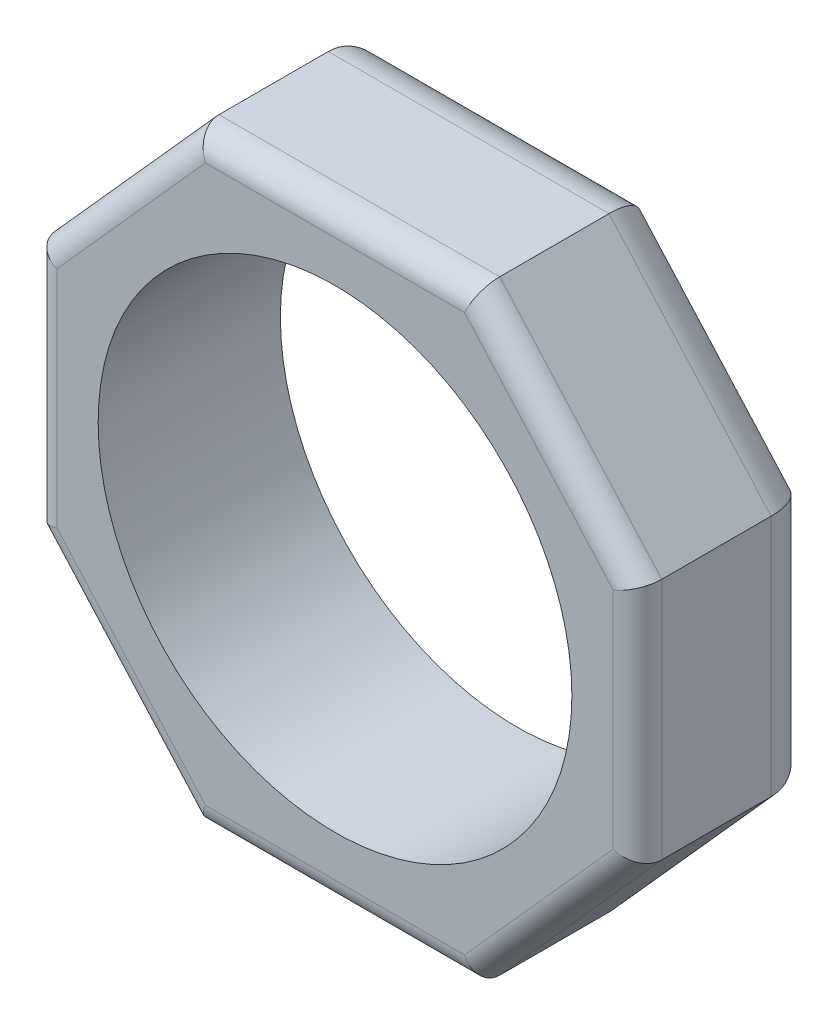
ISO-10303-21;
HEADER;
FILE_DESCRIPTION(('STEP AP214'),'2;1');
FILE_NAME('part.step','',(''),(''),'','','');
FILE_SCHEMA(('AUTOMOTIVE_DESIGN { 1 0 10303 214 1 1 1 1 }'));
ENDSEC;
DATA;
#1=APPLICATION_CONTEXT('core data for automotive mechanical design processes');
#2=APPLICATION_PROTOCOL_DEFINITION('international standard','automotive_design',2000,#1);
#3=PRODUCT_CONTEXT('',#1,'mechanical');
#4=PRODUCT('Part','Part','',(#3));
#5=PRODUCT_RELATED_PRODUCT_CATEGORY('part','',(#4));
#6=PRODUCT_DEFINITION_FORMATION('','',#4);
#7=PRODUCT_DEFINITION_CONTEXT('part definition',#1,'design');
#8=PRODUCT_DEFINITION('design','',#6,#7);
#9=PRODUCT_DEFINITION_SHAPE('','',#8);
#10=(LENGTH_UNIT() NAMED_UNIT(*) SI_UNIT(.MILLI.,.METRE.));
#11=(NAMED_UNIT(*) PLANE_ANGLE_UNIT() SI_UNIT($,.RADIAN.));
#12=(NAMED_UNIT(*) SI_UNIT($,.STERADIAN.) SOLID_ANGLE_UNIT());
#13=UNCERTAINTY_MEASURE_WITH_UNIT(LENGTH_MEASURE(1.E-05),#10,'distance_accuracy_value','');
#14=(GEOMETRIC_REPRESENTATION_CONTEXT(3) GLOBAL_UNCERTAINTY_ASSIGNED_CONTEXT((#13)) GLOBAL_UNIT_ASSIGNED_CONTEXT((#10,
#11,#12)) REPRESENTATION_CONTEXT('',''));
#15=CARTESIAN_POINT('',(0.,0.,0.));
#16=DIRECTION('',(0.,0.,1.));
#17=DIRECTION('',(1.,0.,0.));
#18=AXIS2_PLACEMENT_3D('',#15,#16,#17);
#19=CARTESIAN_POINT('',(-15.8115,-6.35000000000001,9.525));
#20=DIRECTION('',(0.745,0.667064464650907,0.));
#21=DIRECTION('',(-0.667064464650907,0.745,0.));
#22=AXIS2_PLACEMENT_3D('',#19,#20,#21);
#23=PLANE('',#22);
#24=DIRECTION('',(0.,0.,-1.));
#25=VECTOR('',#24,1.);
#26=CARTESIAN_POINT('',(-7.33978129893349,-15.8115,9.525));
#27=LINE('',#26,#25);
#28=CARTESIAN_POINT('',(-7.33978129893349,-15.8115,8.255));
#29=VERTEX_POINT('',#28);
#30=CARTESIAN_POINT('',(-7.33978129893349,-15.8115,2.54));
#31=VERTEX_POINT('',#30);
#32=EDGE_CURVE('E182',#29,#31,#27,.T.);
#33=ORIENTED_EDGE('',*,*,#32,.F.);
#34=DIRECTION('',(0.667064464650907,-0.745,0.));
#35=VECTOR('',#34,1.);
#36=CARTESIAN_POINT('',(-15.8115,-6.35000000000001,8.255));
#37=LINE('',#36,#35);
#38=CARTESIAN_POINT('',(-15.8115,-6.35000000000001,8.255));
#39=VERTEX_POINT('',#38);
#40=EDGE_CURVE('E256',#29,#39,#37,.F.);
#41=ORIENTED_EDGE('',*,*,#40,.T.);
#42=DIRECTION('',(0.,0.,-1.));
#43=VECTOR('',#42,1.);
#44=CARTESIAN_POINT('',(-15.8115,-6.35000000000001,9.525));
#45=LINE('',#44,#43);
#46=CARTESIAN_POINT('',(-15.8115,-6.35000000000001,2.54));
#47=VERTEX_POINT('',#46);
#48=EDGE_CURVE('E236',#39,#47,#45,.T.);
#49=ORIENTED_EDGE('',*,*,#48,.T.);
#50=DIRECTION('',(0.667064464650907,-0.745,0.));
#51=VECTOR('',#50,1.);
#52=CARTESIAN_POINT('',(-7.33978129893349,-15.8115,2.54));
#53=LINE('',#52,#51);
#54=EDGE_CURVE('E210',#47,#31,#53,.T.);
#55=ORIENTED_EDGE('',*,*,#54,.T.);
#56=EDGE_LOOP('',(#33,#41,#49,#55));
#57=FACE_BOUND('',#56,.T.);
#58=ADVANCED_FACE('F36',(#57),#23,.F.);
#59=CARTESIAN_POINT('',(7.3397812989335,-15.8115,9.525));
#60=DIRECTION('',(0.,1.,0.));
#61=DIRECTION('',(0.,0.,1.));
#62=AXIS2_PLACEMENT_3D('',#59,#60,#61);
#63=PLANE('',#62);
#64=DIRECTION('',(0.,0.,-1.));
#65=VECTOR('',#64,1.);
#66=CARTESIAN_POINT('',(7.3397812989335,-15.8115,9.525));
#67=LINE('',#66,#65);
#68=CARTESIAN_POINT('',(7.3397812989335,-15.8115,8.255));
#69=VERTEX_POINT('',#68);
#70=CARTESIAN_POINT('',(7.3397812989335,-15.8115,2.54));
#71=VERTEX_POINT('',#70);
#72=EDGE_CURVE('E186',#69,#71,#67,.T.);
#73=ORIENTED_EDGE('',*,*,#72,.F.);
#74=DIRECTION('',(1.,0.,0.));
#75=VECTOR('',#74,1.);
#76=CARTESIAN_POINT('',(7.3397812989335,-15.8115,8.255));
#77=LINE('',#76,#75);
#78=EDGE_CURVE('E253',#69,#29,#77,.F.);
#79=ORIENTED_EDGE('',*,*,#78,.T.);
#80=ORIENTED_EDGE('',*,*,#32,.T.);
#81=DIRECTION('',(1.,0.,0.));
#82=VECTOR('',#81,1.);
#83=CARTESIAN_POINT('',(7.3397812989335,-15.8115,2.54));
#84=LINE('',#83,#82);
#85=EDGE_CURVE('E215',#31,#71,#84,.T.);
#86=ORIENTED_EDGE('',*,*,#85,.T.);
#87=EDGE_LOOP('',(#73,#79,#80,#86));
#88=FACE_BOUND('',#87,.T.);
#89=ADVANCED_FACE('F315',(#88),#63,.F.);
#90=CARTESIAN_POINT('',(15.8115,-6.35,9.525));
#91=DIRECTION('',(-0.745,0.667064464650906,0.));
#92=DIRECTION('',(-0.667064464650906,-0.745,0.));
#93=AXIS2_PLACEMENT_3D('',#90,#91,#92);
#94=PLANE('',#93);
#95=DIRECTION('',(0.,0.,-1.));
#96=VECTOR('',#95,1.);
#97=CARTESIAN_POINT('',(15.8115,-6.35,9.525));
#98=LINE('',#97,#96);
#99=CARTESIAN_POINT('',(15.8115,-6.35,8.255));
#100=VERTEX_POINT('',#99);
#101=CARTESIAN_POINT('',(15.8115,-6.35,2.54));
#102=VERTEX_POINT('',#101);
#103=EDGE_CURVE('E156',#100,#102,#98,.T.);
#104=ORIENTED_EDGE('',*,*,#103,.F.);
#105=DIRECTION('',(0.667064464650906,0.745,0.));
#106=VECTOR('',#105,1.);
#107=CARTESIAN_POINT('',(15.8115,-6.35,8.255));
#108=LINE('',#107,#106);
#109=EDGE_CURVE('E11',#100,#69,#108,.F.);
#110=ORIENTED_EDGE('',*,*,#109,.T.);
#111=ORIENTED_EDGE('',*,*,#72,.T.);
#112=DIRECTION('',(0.667064464650906,0.745,0.));
#113=VECTOR('',#112,1.);
#114=CARTESIAN_POINT('',(15.8115,-6.35,2.54));
#115=LINE('',#114,#113);
#116=EDGE_CURVE('E213',#71,#102,#115,.T.);
#117=ORIENTED_EDGE('',*,*,#116,.T.);
#118=EDGE_LOOP('',(#104,#110,#111,#117));
#119=FACE_BOUND('',#118,.T.);
#120=ADVANCED_FACE('F307',(#119),#94,.F.);
#121=CARTESIAN_POINT('',(15.8115,6.35,9.525));
#122=DIRECTION('',(-1.,0.,0.));
#123=DIRECTION('',(0.,0.,1.));
#124=AXIS2_PLACEMENT_3D('',#121,#122,#123);
#125=PLANE('',#124);
#126=DIRECTION('',(0.,0.,-1.));
#127=VECTOR('',#126,1.);
#128=CARTESIAN_POINT('',(15.8115,6.35,9.525));
#129=LINE('',#128,#127);
#130=CARTESIAN_POINT('',(15.8115,6.35,8.255));
#131=VERTEX_POINT('',#130);
#132=CARTESIAN_POINT('',(15.8115,6.35,2.54));
#133=VERTEX_POINT('',#132);
#134=EDGE_CURVE('E148',#131,#133,#129,.T.);
#135=ORIENTED_EDGE('',*,*,#134,.F.);
#136=DIRECTION('',(0.,1.,0.));
#137=VECTOR('',#136,1.);
#138=CARTESIAN_POINT('',(15.8115,6.35,8.255));
#139=LINE('',#138,#137);
#140=EDGE_CURVE('E45',#131,#100,#139,.F.);
#141=ORIENTED_EDGE('',*,*,#140,.T.);
#142=ORIENTED_EDGE('',*,*,#103,.T.);
#143=DIRECTION('',(0.,1.,0.));
#144=VECTOR('',#143,1.);
#145=CARTESIAN_POINT('',(15.8115,6.35,2.54));
#146=LINE('',#145,#144);
#147=EDGE_CURVE('E165',#102,#133,#146,.T.);
#148=ORIENTED_EDGE('',*,*,#147,.T.);
#149=EDGE_LOOP('',(#135,#141,#142,#148));
#150=FACE_BOUND('',#149,.T.);
#151=ADVANCED_FACE('F179',(#150),#125,.F.);
#152=CARTESIAN_POINT('',(7.3397812989335,15.8115,9.525));
#153=DIRECTION('',(-0.745,-0.667064464650906,0.));
#154=DIRECTION('',(0.667064464650906,-0.745,0.));
#155=AXIS2_PLACEMENT_3D('',#152,#153,#154);
#156=PLANE('',#155);
#157=DIRECTION('',(0.,0.,-1.));
#158=VECTOR('',#157,1.);
#159=CARTESIAN_POINT('',(7.3397812989335,15.8115,9.525));
#160=LINE('',#159,#158);
#161=CARTESIAN_POINT('',(7.3397812989335,15.8115,8.255));
#162=VERTEX_POINT('',#161);
#163=CARTESIAN_POINT('',(7.3397812989335,15.8115,2.54));
#164=VERTEX_POINT('',#163);
#165=EDGE_CURVE('E157',#162,#164,#160,.T.);
#166=ORIENTED_EDGE('',*,*,#165,.F.);
#167=DIRECTION('',(-0.667064464650906,0.745,0.));
#168=VECTOR('',#167,1.);
#169=CARTESIAN_POINT('',(7.3397812989335,15.8115,8.255));
#170=LINE('',#169,#168);
#171=EDGE_CURVE('E60',#162,#131,#170,.F.);
#172=ORIENTED_EDGE('',*,*,#171,.T.);
#173=ORIENTED_EDGE('',*,*,#134,.T.);
#174=DIRECTION('',(-0.667064464650906,0.745,0.));
#175=VECTOR('',#174,1.);
#176=CARTESIAN_POINT('',(7.3397812989335,15.8115,2.54));
#177=LINE('',#176,#175);
#178=EDGE_CURVE('E152',#133,#164,#177,.T.);
#179=ORIENTED_EDGE('',*,*,#178,.T.);
#180=EDGE_LOOP('',(#166,#172,#173,#179));
#181=FACE_BOUND('',#180,.T.);
#182=ADVANCED_FACE('F150',(#181),#156,.F.);
#183=CARTESIAN_POINT('',(-7.33978129893351,15.8115,9.525));
#184=DIRECTION('',(0.,-1.,0.));
#185=DIRECTION('',(1.,0.,0.));
#186=AXIS2_PLACEMENT_3D('',#183,#184,#185);
#187=PLANE('',#186);
#188=DIRECTION('',(0.,0.,-1.));
#189=VECTOR('',#188,1.);
#190=CARTESIAN_POINT('',(-7.33978129893351,15.8115,9.525));
#191=LINE('',#190,#189);
#192=CARTESIAN_POINT('',(-7.33978129893351,15.8115,8.255));
#193=VERTEX_POINT('',#192);
#194=CARTESIAN_POINT('',(-7.33978129893351,15.8115,2.54));
#195=VERTEX_POINT('',#194);
#196=EDGE_CURVE('E302',#193,#195,#191,.T.);
#197=ORIENTED_EDGE('',*,*,#196,.F.);
#198=DIRECTION('',(-1.,0.,0.));
#199=VECTOR('',#198,1.);
#200=CARTESIAN_POINT('',(-7.33978129893351,15.8115,8.255));
#201=LINE('',#200,#199);
#202=EDGE_CURVE('E262',#193,#162,#201,.F.);
#203=ORIENTED_EDGE('',*,*,#202,.T.);
#204=ORIENTED_EDGE('',*,*,#165,.T.);
#205=DIRECTION('',(-1.,0.,0.));
#206=VECTOR('',#205,1.);
#207=CARTESIAN_POINT('',(-7.33978129893351,15.8115,2.54));
#208=LINE('',#207,#206);
#209=EDGE_CURVE('E177',#164,#195,#208,.T.);
#210=ORIENTED_EDGE('',*,*,#209,.T.);
#211=EDGE_LOOP('',(#197,#203,#204,#210));
#212=FACE_BOUND('',#211,.T.);
#213=ADVANCED_FACE('F333',(#212),#187,.F.);
#214=CARTESIAN_POINT('',(-7.33978129893351,15.8115,9.525));
#215=DIRECTION('',(0.745000000000001,-0.667064464650905,0.));
#216=DIRECTION('',(0.667064464650905,0.745000000000001,0.));
#217=AXIS2_PLACEMENT_3D('',#214,#215,#216);
#218=PLANE('',#217);
#219=DIRECTION('',(0.,0.,-1.));
#220=VECTOR('',#219,1.);
#221=CARTESIAN_POINT('',(-15.8115,6.34999999999999,9.525));
#222=LINE('',#221,#220);
#223=CARTESIAN_POINT('',(-15.8115,6.34999999999999,8.255));
#224=VERTEX_POINT('',#223);
#225=CARTESIAN_POINT('',(-15.8115,6.34999999999999,2.54));
#226=VERTEX_POINT('',#225);
#227=EDGE_CURVE('E300',#224,#226,#222,.T.);
#228=ORIENTED_EDGE('',*,*,#227,.F.);
#229=DIRECTION('',(-0.667064464650905,-0.745000000000001,0.));
#230=VECTOR('',#229,1.);
#231=CARTESIAN_POINT('',(-7.33978129893351,15.8115,8.255));
#232=LINE('',#231,#230);
#233=EDGE_CURVE('E260',#224,#193,#232,.F.);
#234=ORIENTED_EDGE('',*,*,#233,.T.);
#235=ORIENTED_EDGE('',*,*,#196,.T.);
#236=DIRECTION('',(-0.667064464650905,-0.745000000000001,0.));
#237=VECTOR('',#236,1.);
#238=CARTESIAN_POINT('',(-15.8115,6.34999999999999,2.54));
#239=LINE('',#238,#237);
#240=EDGE_CURVE('E204',#195,#226,#239,.T.);
#241=ORIENTED_EDGE('',*,*,#240,.T.);
#242=EDGE_LOOP('',(#228,#234,#235,#241));
#243=FACE_BOUND('',#242,.T.);
#244=ADVANCED_FACE('F341',(#243),#218,.F.);
#245=CARTESIAN_POINT('',(-15.8115,6.34999999999999,9.525));
#246=DIRECTION('',(1.,0.,0.));
#247=DIRECTION('',(0.,1.,0.));
#248=AXIS2_PLACEMENT_3D('',#245,#246,#247);
#249=PLANE('',#248);
#250=ORIENTED_EDGE('',*,*,#48,.F.);
#251=DIRECTION('',(0.,-1.,0.));
#252=VECTOR('',#251,1.);
#253=CARTESIAN_POINT('',(-15.8115,6.34999999999999,8.255));
#254=LINE('',#253,#252);
#255=EDGE_CURVE('E258',#39,#224,#254,.F.);
#256=ORIENTED_EDGE('',*,*,#255,.T.);
#257=ORIENTED_EDGE('',*,*,#227,.T.);
#258=DIRECTION('',(0.,-1.,0.));
#259=VECTOR('',#258,1.);
#260=CARTESIAN_POINT('',(-15.8115,-6.35000000000001,2.54));
#261=LINE('',#260,#259);
#262=EDGE_CURVE('E207',#226,#47,#261,.T.);
#263=ORIENTED_EDGE('',*,*,#262,.T.);
#264=EDGE_LOOP('',(#250,#256,#257,#263));
#265=FACE_BOUND('',#264,.T.);
#266=ADVANCED_FACE('F349',(#265),#249,.F.);
#267=CARTESIAN_POINT('',(0.,0.,9.525));
#268=DIRECTION('',(0.,0.,-1.));
#269=DIRECTION('',(-1.,0.,0.));
#270=AXIS2_PLACEMENT_3D('',#267,#268,#269);
#271=PLANE('',#270);
#272=DIRECTION('',(0.667064464650907,-0.745,0.));
#273=VECTOR('',#272,1.);
#274=CARTESIAN_POINT('',(-10.9853430036473,-9.83615026810007,9.525));
#275=LINE('',#274,#273);
#276=CARTESIAN_POINT('',(-14.5415,-5.86451468761797,9.525));
#277=VERTEX_POINT('',#276);
#278=CARTESIAN_POINT('',(-6.77222676216389,-14.5415,9.525));
#279=VERTEX_POINT('',#278);
#280=EDGE_CURVE('E248',#277,#279,#275,.T.);
#281=ORIENTED_EDGE('',*,*,#280,.T.);
#282=DIRECTION('',(1.,0.,0.));
#283=VECTOR('',#282,1.);
#284=CARTESIAN_POINT('',(0.,-14.5415,9.525));
#285=LINE('',#284,#283);
#286=CARTESIAN_POINT('',(6.7722267621639,-14.5415,9.525));
#287=VERTEX_POINT('',#286);
#288=EDGE_CURVE('E250',#279,#287,#285,.T.);
#289=ORIENTED_EDGE('',*,*,#288,.T.);
#290=DIRECTION('',(0.667064464650906,0.745,0.));
#291=VECTOR('',#290,1.);
#292=CARTESIAN_POINT('',(10.9853430036473,-9.83615026810006,9.525));
#293=LINE('',#292,#291);
#294=CARTESIAN_POINT('',(14.5415,-5.86451468761797,9.525));
#295=VERTEX_POINT('',#294);
#296=EDGE_CURVE('E217',#287,#295,#293,.T.);
#297=ORIENTED_EDGE('',*,*,#296,.T.);
#298=DIRECTION('',(0.,1.,0.));
#299=VECTOR('',#298,1.);
#300=CARTESIAN_POINT('',(14.5415,0.,9.525));
#301=LINE('',#300,#299);
#302=CARTESIAN_POINT('',(14.5415,5.86451468761797,9.525));
#303=VERTEX_POINT('',#302);
#304=EDGE_CURVE('E238',#295,#303,#301,.T.);
#305=ORIENTED_EDGE('',*,*,#304,.T.);
#306=DIRECTION('',(-0.667064464650906,0.745,0.));
#307=VECTOR('',#306,1.);
#308=CARTESIAN_POINT('',(10.9853430036473,9.83615026810006,9.525));
#309=LINE('',#308,#307);
#310=CARTESIAN_POINT('',(6.77222676216391,14.5415,9.525));
#311=VERTEX_POINT('',#310);
#312=EDGE_CURVE('E240',#303,#311,#309,.T.);
#313=ORIENTED_EDGE('',*,*,#312,.T.);
#314=DIRECTION('',(-1.,0.,0.));
#315=VECTOR('',#314,1.);
#316=CARTESIAN_POINT('',(0.,14.5415,9.525));
#317=LINE('',#316,#315);
#318=CARTESIAN_POINT('',(-6.77222676216391,14.5415,9.525));
#319=VERTEX_POINT('',#318);
#320=EDGE_CURVE('E242',#311,#319,#317,.T.);
#321=ORIENTED_EDGE('',*,*,#320,.T.);
#322=DIRECTION('',(-0.667064464650905,-0.745000000000001,0.));
#323=VECTOR('',#322,1.);
#324=CARTESIAN_POINT('',(-10.9853430036473,9.83615026810005,9.525));
#325=LINE('',#324,#323);
#326=CARTESIAN_POINT('',(-14.5415,5.86451468761795,9.525));
#327=VERTEX_POINT('',#326);
#328=EDGE_CURVE('E244',#319,#327,#325,.T.);
#329=ORIENTED_EDGE('',*,*,#328,.T.);
#330=DIRECTION('',(0.,-1.,0.));
#331=VECTOR('',#330,1.);
#332=CARTESIAN_POINT('',(-14.5415,0.,9.525));
#333=LINE('',#332,#331);
#334=EDGE_CURVE('E246',#327,#277,#333,.T.);
#335=ORIENTED_EDGE('',*,*,#334,.T.);
#336=EDGE_LOOP('',(#281,#289,#297,#305,#313,#321,#329,#335));
#337=FACE_BOUND('',#336,.T.);
#338=CARTESIAN_POINT('',(0.,0.,9.525));
#339=DIRECTION('',(0.,0.,-1.));
#340=DIRECTION('',(-1.,0.,0.));
#341=AXIS2_PLACEMENT_3D('',#338,#339,#340);
#342=CIRCLE('',#341,12.3825);
#343=CARTESIAN_POINT('',(-12.3825,0.,9.525));
#344=VERTEX_POINT('',#343);
#345=EDGE_CURVE('E171',#344,#344,#342,.T.);
#346=ORIENTED_EDGE('',*,*,#345,.T.);
#347=EDGE_LOOP('',(#346));
#348=FACE_BOUND('',#347,.T.);
#349=ADVANCED_FACE('F363',(#337,#348),#271,.F.);
#350=CARTESIAN_POINT('',(0.,0.,0.));
#351=DIRECTION('',(0.,0.,-1.));
#352=DIRECTION('',(-1.,0.,0.));
#353=AXIS2_PLACEMENT_3D('',#350,#351,#352);
#354=PLANE('',#353);
#355=CARTESIAN_POINT('',(0.,0.,0.));
#356=DIRECTION('',(0.,0.,-1.));
#357=DIRECTION('',(-1.,0.,0.));
#358=AXIS2_PLACEMENT_3D('',#355,#356,#357);
#359=CIRCLE('',#358,12.3825);
#360=CARTESIAN_POINT('',(-12.3825,0.,0.));
#361=VERTEX_POINT('',#360);
#362=EDGE_CURVE('E287',#361,#361,#359,.T.);
#363=ORIENTED_EDGE('',*,*,#362,.F.);
#364=EDGE_LOOP('',(#363));
#365=FACE_BOUND('',#364,.T.);
#366=DIRECTION('',(-0.667064464650906,0.745,0.));
#367=VECTOR('',#366,1.);
#368=CARTESIAN_POINT('',(13.9192,4.65565625978669,0.));
#369=LINE('',#368,#367);
#370=CARTESIAN_POINT('',(6.20467222539431,13.2715,0.));
#371=VERTEX_POINT('',#370);
#372=CARTESIAN_POINT('',(13.2715,5.37902937523593,0.));
#373=VERTEX_POINT('',#372);
#374=EDGE_CURVE('E199',#371,#373,#369,.F.);
#375=ORIENTED_EDGE('',*,*,#374,.T.);
#376=DIRECTION('',(0.,1.,0.));
#377=VECTOR('',#376,1.);
#378=CARTESIAN_POINT('',(13.2715,-6.35,0.));
#379=LINE('',#378,#377);
#380=CARTESIAN_POINT('',(13.2715,-5.37902937523593,0.));
#381=VERTEX_POINT('',#380);
#382=EDGE_CURVE('E167',#373,#381,#379,.F.);
#383=ORIENTED_EDGE('',*,*,#382,.T.);
#384=DIRECTION('',(0.667064464650906,0.745,0.));
#385=VECTOR('',#384,1.);
#386=CARTESIAN_POINT('',(5.4474812989335,-14.1171562597867,0.));
#387=LINE('',#386,#385);
#388=CARTESIAN_POINT('',(6.2046722253943,-13.2715,0.));
#389=VERTEX_POINT('',#388);
#390=EDGE_CURVE('E184',#381,#389,#387,.F.);
#391=ORIENTED_EDGE('',*,*,#390,.T.);
#392=DIRECTION('',(1.,0.,0.));
#393=VECTOR('',#392,1.);
#394=CARTESIAN_POINT('',(-7.33978129893349,-13.2715,0.));
#395=LINE('',#394,#393);
#396=CARTESIAN_POINT('',(-6.2046722253943,-13.2715,0.));
#397=VERTEX_POINT('',#396);
#398=EDGE_CURVE('E181',#389,#397,#395,.F.);
#399=ORIENTED_EDGE('',*,*,#398,.T.);
#400=DIRECTION('',(0.667064464650907,-0.745,0.));
#401=VECTOR('',#400,1.);
#402=CARTESIAN_POINT('',(-13.9192,-4.6556562597867,0.));
#403=LINE('',#402,#401);
#404=CARTESIAN_POINT('',(-13.2715,-5.37902937523594,0.));
#405=VERTEX_POINT('',#404);
#406=EDGE_CURVE('E191',#397,#405,#403,.F.);
#407=ORIENTED_EDGE('',*,*,#406,.T.);
#408=DIRECTION('',(0.,-1.,0.));
#409=VECTOR('',#408,1.);
#410=CARTESIAN_POINT('',(-13.2715,6.34999999999999,0.));
#411=LINE('',#410,#409);
#412=CARTESIAN_POINT('',(-13.2715,5.37902937523592,0.));
#413=VERTEX_POINT('',#412);
#414=EDGE_CURVE('E193',#405,#413,#411,.F.);
#415=ORIENTED_EDGE('',*,*,#414,.T.);
#416=DIRECTION('',(-0.667064464650905,-0.745000000000001,0.));
#417=VECTOR('',#416,1.);
#418=CARTESIAN_POINT('',(-5.44748129893351,14.1171562597867,0.));
#419=LINE('',#418,#417);
#420=CARTESIAN_POINT('',(-6.20467222539432,13.2715,0.));
#421=VERTEX_POINT('',#420);
#422=EDGE_CURVE('E195',#413,#421,#419,.F.);
#423=ORIENTED_EDGE('',*,*,#422,.T.);
#424=DIRECTION('',(-1.,0.,0.));
#425=VECTOR('',#424,1.);
#426=CARTESIAN_POINT('',(7.3397812989335,13.2715,0.));
#427=LINE('',#426,#425);
#428=EDGE_CURVE('E197',#421,#371,#427,.F.);
#429=ORIENTED_EDGE('',*,*,#428,.T.);
#430=EDGE_LOOP('',(#375,#383,#391,#399,#407,#415,#423,#429));
#431=FACE_BOUND('',#430,.T.);
#432=ADVANCED_FACE('F324',(#365,#431),#354,.T.);
#433=CARTESIAN_POINT('',(-13.2715,6.34999999999999,2.54));
#434=DIRECTION('',(0.,1.,0.));
#435=DIRECTION('',(-1.,0.,0.));
#436=AXIS2_PLACEMENT_3D('',#433,#434,#435);
#437=CYLINDRICAL_SURFACE('',#436,2.54);
#438=CARTESIAN_POINT('',(-13.2715,5.37902937523592,2.54));
#439=DIRECTION('',(0.357071421427142,0.934077084613471,0.));
#440=DIRECTION('',(-0.934077084613471,0.357071421427142,0.));
#441=AXIS2_PLACEMENT_3D('',#438,#439,#440);
#442=ELLIPSE('',#441,2.71926165606672,2.54);
#443=EDGE_CURVE('E230',#413,#226,#442,.T.);
#444=ORIENTED_EDGE('',*,*,#443,.F.);
#445=ORIENTED_EDGE('',*,*,#414,.F.);
#446=CARTESIAN_POINT('',(-13.2715,-5.37902937523594,2.54));
#447=DIRECTION('',(-0.357071421427143,0.93407708461347,0.));
#448=DIRECTION('',(-0.93407708461347,-0.357071421427143,0.));
#449=AXIS2_PLACEMENT_3D('',#446,#447,#448);
#450=ELLIPSE('',#449,2.71926165606672,2.54);
#451=EDGE_CURVE('E233',#47,#405,#450,.F.);
#452=ORIENTED_EDGE('',*,*,#451,.F.);
#453=ORIENTED_EDGE('',*,*,#262,.F.);
#454=EDGE_LOOP('',(#444,#445,#452,#453));
#455=FACE_BOUND('',#454,.T.);
#456=ADVANCED_FACE('F344',(#455),#437,.T.);
#457=CARTESIAN_POINT('',(-13.9192,-4.6556562597867,2.54));
#458=DIRECTION('',(-0.667064464650907,0.745,0.));
#459=DIRECTION('',(-0.745,-0.667064464650907,0.));
#460=AXIS2_PLACEMENT_3D('',#457,#458,#459);
#461=CYLINDRICAL_SURFACE('',#460,2.54);
#462=ORIENTED_EDGE('',*,*,#451,.T.);
#463=ORIENTED_EDGE('',*,*,#406,.F.);
#464=CARTESIAN_POINT('',(-6.20467222539429,-13.2715,2.54));
#465=DIRECTION('',(-0.912979864140197,0.408004617222093,0.));
#466=DIRECTION('',(-0.408004617222093,-0.912979864140197,0.));
#467=AXIS2_PLACEMENT_3D('',#464,#465,#466);
#468=ELLIPSE('',#467,2.78209859797078,2.54);
#469=EDGE_CURVE('E227',#31,#397,#468,.F.);
#470=ORIENTED_EDGE('',*,*,#469,.F.);
#471=ORIENTED_EDGE('',*,*,#54,.F.);
#472=EDGE_LOOP('',(#462,#463,#470,#471));
#473=FACE_BOUND('',#472,.T.);
#474=ADVANCED_FACE('F397',(#473),#461,.T.);
#475=CARTESIAN_POINT('',(-5.44748129893351,14.1171562597867,2.54));
#476=DIRECTION('',(0.667064464650905,0.745000000000001,0.));
#477=DIRECTION('',(-0.745000000000001,0.667064464650905,0.));
#478=AXIS2_PLACEMENT_3D('',#475,#476,#477);
#479=CYLINDRICAL_SURFACE('',#478,2.54);
#480=ORIENTED_EDGE('',*,*,#443,.T.);
#481=ORIENTED_EDGE('',*,*,#240,.F.);
#482=CARTESIAN_POINT('',(-6.20467222539432,13.2715,2.54));
#483=DIRECTION('',(0.912979864140197,0.408004617222094,0.));
#484=DIRECTION('',(-0.408004617222094,0.912979864140197,0.));
#485=AXIS2_PLACEMENT_3D('',#482,#483,#484);
#486=ELLIPSE('',#485,2.78209859797078,2.54);
#487=EDGE_CURVE('E224',#421,#195,#486,.T.);
#488=ORIENTED_EDGE('',*,*,#487,.F.);
#489=ORIENTED_EDGE('',*,*,#422,.F.);
#490=EDGE_LOOP('',(#480,#481,#488,#489));
#491=FACE_BOUND('',#490,.T.);
#492=ADVANCED_FACE('F336',(#491),#479,.T.);
#493=CARTESIAN_POINT('',(7.3397812989335,-13.2715,2.54));
#494=DIRECTION('',(-1.,0.,0.));
#495=DIRECTION('',(0.,0.,1.));
#496=AXIS2_PLACEMENT_3D('',#493,#494,#495);
#497=CYLINDRICAL_SURFACE('',#496,2.54);
#498=ORIENTED_EDGE('',*,*,#469,.T.);
#499=ORIENTED_EDGE('',*,*,#398,.F.);
#500=CARTESIAN_POINT('',(6.2046722253943,-13.2715,2.54));
#501=DIRECTION('',(-0.912979864140197,-0.408004617222093,0.));
#502=DIRECTION('',(-0.408004617222093,0.912979864140197,0.));
#503=AXIS2_PLACEMENT_3D('',#500,#501,#502);
#504=ELLIPSE('',#503,2.78209859797078,2.54);
#505=EDGE_CURVE('E221',#71,#389,#504,.F.);
#506=ORIENTED_EDGE('',*,*,#505,.F.);
#507=ORIENTED_EDGE('',*,*,#85,.F.);
#508=EDGE_LOOP('',(#498,#499,#506,#507));
#509=FACE_BOUND('',#508,.T.);
#510=ADVANCED_FACE('F319',(#509),#497,.T.);
#511=CARTESIAN_POINT('',(-7.33978129893351,13.2715,2.54));
#512=DIRECTION('',(1.,0.,0.));
#513=DIRECTION('',(0.,1.,0.));
#514=AXIS2_PLACEMENT_3D('',#511,#512,#513);
#515=CYLINDRICAL_SURFACE('',#514,2.54);
#516=ORIENTED_EDGE('',*,*,#487,.T.);
#517=ORIENTED_EDGE('',*,*,#209,.F.);
#518=CARTESIAN_POINT('',(6.2046722253943,13.2715,2.54));
#519=DIRECTION('',(0.912979864140197,-0.408004617222094,0.));
#520=DIRECTION('',(0.408004617222093,0.912979864140197,0.));
#521=AXIS2_PLACEMENT_3D('',#518,#519,#520);
#522=ELLIPSE('',#521,2.78209859797078,2.54);
#523=EDGE_CURVE('E176',#371,#164,#522,.T.);
#524=ORIENTED_EDGE('',*,*,#523,.F.);
#525=ORIENTED_EDGE('',*,*,#428,.F.);
#526=EDGE_LOOP('',(#516,#517,#524,#525));
#527=FACE_BOUND('',#526,.T.);
#528=ADVANCED_FACE('F329',(#527),#515,.T.);
#529=CARTESIAN_POINT('',(13.9192,-4.6556562597867,2.54));
#530=DIRECTION('',(-0.667064464650906,-0.745,0.));
#531=DIRECTION('',(0.745,-0.667064464650906,0.));
#532=AXIS2_PLACEMENT_3D('',#529,#530,#531);
#533=CYLINDRICAL_SURFACE('',#532,2.54);
#534=ORIENTED_EDGE('',*,*,#505,.T.);
#535=ORIENTED_EDGE('',*,*,#390,.F.);
#536=CARTESIAN_POINT('',(13.2715,-5.37902937523593,2.54));
#537=DIRECTION('',(-0.357071421427142,-0.93407708461347,0.));
#538=DIRECTION('',(-0.93407708461347,0.357071421427142,0.));
#539=AXIS2_PLACEMENT_3D('',#536,#537,#538);
#540=ELLIPSE('',#539,2.71926165606672,2.54);
#541=EDGE_CURVE('E170',#102,#381,#540,.F.);
#542=ORIENTED_EDGE('',*,*,#541,.F.);
#543=ORIENTED_EDGE('',*,*,#116,.F.);
#544=EDGE_LOOP('',(#534,#535,#542,#543));
#545=FACE_BOUND('',#544,.T.);
#546=ADVANCED_FACE('F322',(#545),#533,.T.);
#547=CARTESIAN_POINT('',(5.4474812989335,14.1171562597867,2.54));
#548=DIRECTION('',(0.667064464650906,-0.745,0.));
#549=DIRECTION('',(0.745,0.667064464650906,0.));
#550=AXIS2_PLACEMENT_3D('',#547,#548,#549);
#551=CYLINDRICAL_SURFACE('',#550,2.54);
#552=ORIENTED_EDGE('',*,*,#523,.T.);
#553=ORIENTED_EDGE('',*,*,#178,.F.);
#554=CARTESIAN_POINT('',(13.2715,5.37902937523593,2.54));
#555=DIRECTION('',(0.357071421427142,-0.93407708461347,0.));
#556=DIRECTION('',(0.93407708461347,0.357071421427142,0.));
#557=AXIS2_PLACEMENT_3D('',#554,#555,#556);
#558=ELLIPSE('',#557,2.71926165606672,2.54);
#559=EDGE_CURVE('E163',#373,#133,#558,.T.);
#560=ORIENTED_EDGE('',*,*,#559,.F.);
#561=ORIENTED_EDGE('',*,*,#374,.F.);
#562=EDGE_LOOP('',(#552,#553,#560,#561));
#563=FACE_BOUND('',#562,.T.);
#564=ADVANCED_FACE('F174',(#563),#551,.T.);
#565=CARTESIAN_POINT('',(13.2715,6.35,2.54));
#566=DIRECTION('',(0.,-1.,0.));
#567=DIRECTION('',(0.,0.,-1.));
#568=AXIS2_PLACEMENT_3D('',#565,#566,#567);
#569=CYLINDRICAL_SURFACE('',#568,2.54);
#570=ORIENTED_EDGE('',*,*,#541,.T.);
#571=ORIENTED_EDGE('',*,*,#382,.F.);
#572=ORIENTED_EDGE('',*,*,#559,.T.);
#573=ORIENTED_EDGE('',*,*,#147,.F.);
#574=EDGE_LOOP('',(#570,#571,#572,#573));
#575=FACE_BOUND('',#574,.T.);
#576=ADVANCED_FACE('F164',(#575),#569,.T.);
#577=CARTESIAN_POINT('',(0.,0.,9.525));
#578=DIRECTION('',(0.,0.,-1.));
#579=DIRECTION('',(-1.,0.,0.));
#580=AXIS2_PLACEMENT_3D('',#577,#578,#579);
#581=CYLINDRICAL_SURFACE('',#580,12.3825);
#582=ORIENTED_EDGE('',*,*,#345,.F.);
#583=EDGE_LOOP('',(#582));
#584=FACE_BOUND('',#583,.T.);
#585=ORIENTED_EDGE('',*,*,#362,.T.);
#586=EDGE_LOOP('',(#585));
#587=FACE_BOUND('',#586,.T.);
#588=ADVANCED_FACE('F374',(#584,#587),#581,.F.);
#589=CARTESIAN_POINT('',(0.,14.5415,8.255));
#590=DIRECTION('',(-1.,0.,0.));
#591=DIRECTION('',(0.,-1.,0.));
#592=AXIS2_PLACEMENT_3D('',#589,#590,#591);
#593=CYLINDRICAL_SURFACE('',#592,1.27);
#594=CARTESIAN_POINT('',(6.7722267621639,14.5415,8.255));
#595=DIRECTION('',(-0.912979864140197,0.408004617222094,0.));
#596=DIRECTION('',(0.408004617222093,0.912979864140197,0.));
#597=AXIS2_PLACEMENT_3D('',#594,#595,#596);
#598=ELLIPSE('',#597,1.39104929898539,1.27);
#599=EDGE_CURVE('E281',#162,#311,#598,.F.);
#600=ORIENTED_EDGE('',*,*,#599,.F.);
#601=ORIENTED_EDGE('',*,*,#202,.F.);
#602=CARTESIAN_POINT('',(-6.77222676216391,14.5415,8.255));
#603=DIRECTION('',(-0.912979864140197,-0.408004617222094,0.));
#604=DIRECTION('',(-0.408004617222094,0.912979864140197,0.));
#605=AXIS2_PLACEMENT_3D('',#602,#603,#604);
#606=ELLIPSE('',#605,1.39104929898539,1.27);
#607=EDGE_CURVE('E40',#319,#193,#606,.T.);
#608=ORIENTED_EDGE('',*,*,#607,.F.);
#609=ORIENTED_EDGE('',*,*,#320,.F.);
#610=EDGE_LOOP('',(#600,#601,#608,#609));
#611=FACE_BOUND('',#610,.T.);
#612=ADVANCED_FACE('F38',(#611),#593,.T.);
#613=CARTESIAN_POINT('',(-10.9853430036473,9.83615026810005,8.255));
#614=DIRECTION('',(-0.667064464650905,-0.745000000000001,0.));
#615=DIRECTION('',(0.745000000000001,-0.667064464650905,0.));
#616=AXIS2_PLACEMENT_3D('',#613,#614,#615);
#617=CYLINDRICAL_SURFACE('',#616,1.27);
#618=ORIENTED_EDGE('',*,*,#607,.T.);
#619=ORIENTED_EDGE('',*,*,#233,.F.);
#620=CARTESIAN_POINT('',(-14.5415,5.86451468761795,8.255));
#621=DIRECTION('',(-0.357071421427142,-0.934077084613471,0.));
#622=DIRECTION('',(-0.934077084613471,0.357071421427142,0.));
#623=AXIS2_PLACEMENT_3D('',#620,#621,#622);
#624=ELLIPSE('',#623,1.35963082803336,1.27);
#625=EDGE_CURVE('E279',#327,#224,#624,.T.);
#626=ORIENTED_EDGE('',*,*,#625,.F.);
#627=ORIENTED_EDGE('',*,*,#328,.F.);
#628=EDGE_LOOP('',(#618,#619,#626,#627));
#629=FACE_BOUND('',#628,.T.);
#630=ADVANCED_FACE('F366',(#629),#617,.T.);
#631=CARTESIAN_POINT('',(10.9853430036473,9.83615026810006,8.255));
#632=DIRECTION('',(-0.667064464650906,0.745,0.));
#633=DIRECTION('',(-0.745,-0.667064464650906,0.));
#634=AXIS2_PLACEMENT_3D('',#631,#632,#633);
#635=CYLINDRICAL_SURFACE('',#634,1.27);
#636=ORIENTED_EDGE('',*,*,#599,.T.);
#637=ORIENTED_EDGE('',*,*,#312,.F.);
#638=CARTESIAN_POINT('',(14.5415,5.86451468761796,8.255));
#639=DIRECTION('',(-0.357071421427142,0.93407708461347,0.));
#640=DIRECTION('',(0.93407708461347,0.357071421427142,0.));
#641=AXIS2_PLACEMENT_3D('',#638,#639,#640);
#642=ELLIPSE('',#641,1.35963082803336,1.27);
#643=EDGE_CURVE('E276',#131,#303,#642,.F.);
#644=ORIENTED_EDGE('',*,*,#643,.F.);
#645=ORIENTED_EDGE('',*,*,#171,.F.);
#646=EDGE_LOOP('',(#636,#637,#644,#645));
#647=FACE_BOUND('',#646,.T.);
#648=ADVANCED_FACE('F368',(#647),#635,.T.);
#649=CARTESIAN_POINT('',(-14.5415,0.,8.255));
#650=DIRECTION('',(0.,-1.,0.));
#651=DIRECTION('',(1.,0.,0.));
#652=AXIS2_PLACEMENT_3D('',#649,#650,#651);
#653=CYLINDRICAL_SURFACE('',#652,1.27);
#654=ORIENTED_EDGE('',*,*,#625,.T.);
#655=ORIENTED_EDGE('',*,*,#255,.F.);
#656=CARTESIAN_POINT('',(-14.5415,-5.86451468761797,8.255));
#657=DIRECTION('',(0.357071421427143,-0.93407708461347,0.));
#658=DIRECTION('',(-0.93407708461347,-0.357071421427143,0.));
#659=AXIS2_PLACEMENT_3D('',#656,#657,#658);
#660=ELLIPSE('',#659,1.35963082803336,1.27);
#661=EDGE_CURVE('E273',#277,#39,#660,.T.);
#662=ORIENTED_EDGE('',*,*,#661,.F.);
#663=ORIENTED_EDGE('',*,*,#334,.F.);
#664=EDGE_LOOP('',(#654,#655,#662,#663));
#665=FACE_BOUND('',#664,.T.);
#666=ADVANCED_FACE('F353',(#665),#653,.T.);
#667=CARTESIAN_POINT('',(14.5415,0.,8.255));
#668=DIRECTION('',(0.,1.,0.));
#669=DIRECTION('',(0.,0.,1.));
#670=AXIS2_PLACEMENT_3D('',#667,#668,#669);
#671=CYLINDRICAL_SURFACE('',#670,1.27);
#672=ORIENTED_EDGE('',*,*,#643,.T.);
#673=ORIENTED_EDGE('',*,*,#304,.F.);
#674=CARTESIAN_POINT('',(14.5415,-5.86451468761797,8.255));
#675=DIRECTION('',(0.357071421427142,0.93407708461347,0.));
#676=DIRECTION('',(0.93407708461347,-0.357071421427142,0.));
#677=AXIS2_PLACEMENT_3D('',#674,#675,#676);
#678=ELLIPSE('',#677,1.35963082803336,1.27);
#679=EDGE_CURVE('E270',#100,#295,#678,.F.);
#680=ORIENTED_EDGE('',*,*,#679,.F.);
#681=ORIENTED_EDGE('',*,*,#140,.F.);
#682=EDGE_LOOP('',(#672,#673,#680,#681));
#683=FACE_BOUND('',#682,.T.);
#684=ADVANCED_FACE('F413',(#683),#671,.T.);
#685=CARTESIAN_POINT('',(-10.9853430036473,-9.83615026810007,8.255));
#686=DIRECTION('',(0.667064464650907,-0.745,0.));
#687=DIRECTION('',(0.745,0.667064464650907,0.));
#688=AXIS2_PLACEMENT_3D('',#685,#686,#687);
#689=CYLINDRICAL_SURFACE('',#688,1.27);
#690=ORIENTED_EDGE('',*,*,#661,.T.);
#691=ORIENTED_EDGE('',*,*,#40,.F.);
#692=CARTESIAN_POINT('',(-6.77222676216389,-14.5415,8.255));
#693=DIRECTION('',(0.912979864140197,-0.408004617222093,0.));
#694=DIRECTION('',(-0.408004617222093,-0.912979864140197,0.));
#695=AXIS2_PLACEMENT_3D('',#692,#693,#694);
#696=ELLIPSE('',#695,1.39104929898539,1.27);
#697=EDGE_CURVE('E268',#279,#29,#696,.T.);
#698=ORIENTED_EDGE('',*,*,#697,.F.);
#699=ORIENTED_EDGE('',*,*,#280,.F.);
#700=EDGE_LOOP('',(#690,#691,#698,#699));
#701=FACE_BOUND('',#700,.T.);
#702=ADVANCED_FACE('F359',(#701),#689,.T.);
#703=CARTESIAN_POINT('',(10.9853430036473,-9.83615026810006,8.255));
#704=DIRECTION('',(0.667064464650906,0.745,0.));
#705=DIRECTION('',(-0.745,0.667064464650906,0.));
#706=AXIS2_PLACEMENT_3D('',#703,#704,#705);
#707=CYLINDRICAL_SURFACE('',#706,1.27);
#708=ORIENTED_EDGE('',*,*,#679,.T.);
#709=ORIENTED_EDGE('',*,*,#296,.F.);
#710=CARTESIAN_POINT('',(6.7722267621639,-14.5415,8.255));
#711=DIRECTION('',(0.912979864140197,0.408004617222093,0.));
#712=DIRECTION('',(-0.408004617222093,0.912979864140197,0.));
#713=AXIS2_PLACEMENT_3D('',#710,#711,#712);
#714=ELLIPSE('',#713,1.39104929898539,1.27);
#715=EDGE_CURVE('E266',#69,#287,#714,.F.);
#716=ORIENTED_EDGE('',*,*,#715,.F.);
#717=ORIENTED_EDGE('',*,*,#109,.F.);
#718=EDGE_LOOP('',(#708,#709,#716,#717));
#719=FACE_BOUND('',#718,.T.);
#720=ADVANCED_FACE('F406',(#719),#707,.T.);
#721=CARTESIAN_POINT('',(0.,-14.5415,8.255));
#722=DIRECTION('',(1.,0.,0.));
#723=DIRECTION('',(0.,0.,-1.));
#724=AXIS2_PLACEMENT_3D('',#721,#722,#723);
#725=CYLINDRICAL_SURFACE('',#724,1.27);
#726=ORIENTED_EDGE('',*,*,#697,.T.);
#727=ORIENTED_EDGE('',*,*,#78,.F.);
#728=ORIENTED_EDGE('',*,*,#715,.T.);
#729=ORIENTED_EDGE('',*,*,#288,.F.);
#730=EDGE_LOOP('',(#726,#727,#728,#729));
#731=FACE_BOUND('',#730,.T.);
#732=ADVANCED_FACE('F403',(#731),#725,.T.);
#733=CLOSED_SHELL('',(#58,#89,#120,#151,#182,#213,#244,#266,#349,#432,#456,#474,#492,#510,#528,
#546,#564,#576,#588,#612,#630,#648,#666,#684,#702,#720,#732));
#734=MANIFOLD_SOLID_BREP('B2',#733);
#735=ADVANCED_BREP_SHAPE_REPRESENTATION('',(#18,#734),#14);
#736=SHAPE_DEFINITION_REPRESENTATION(#9,#735);
ENDSEC;
END-ISO-10303-21;
